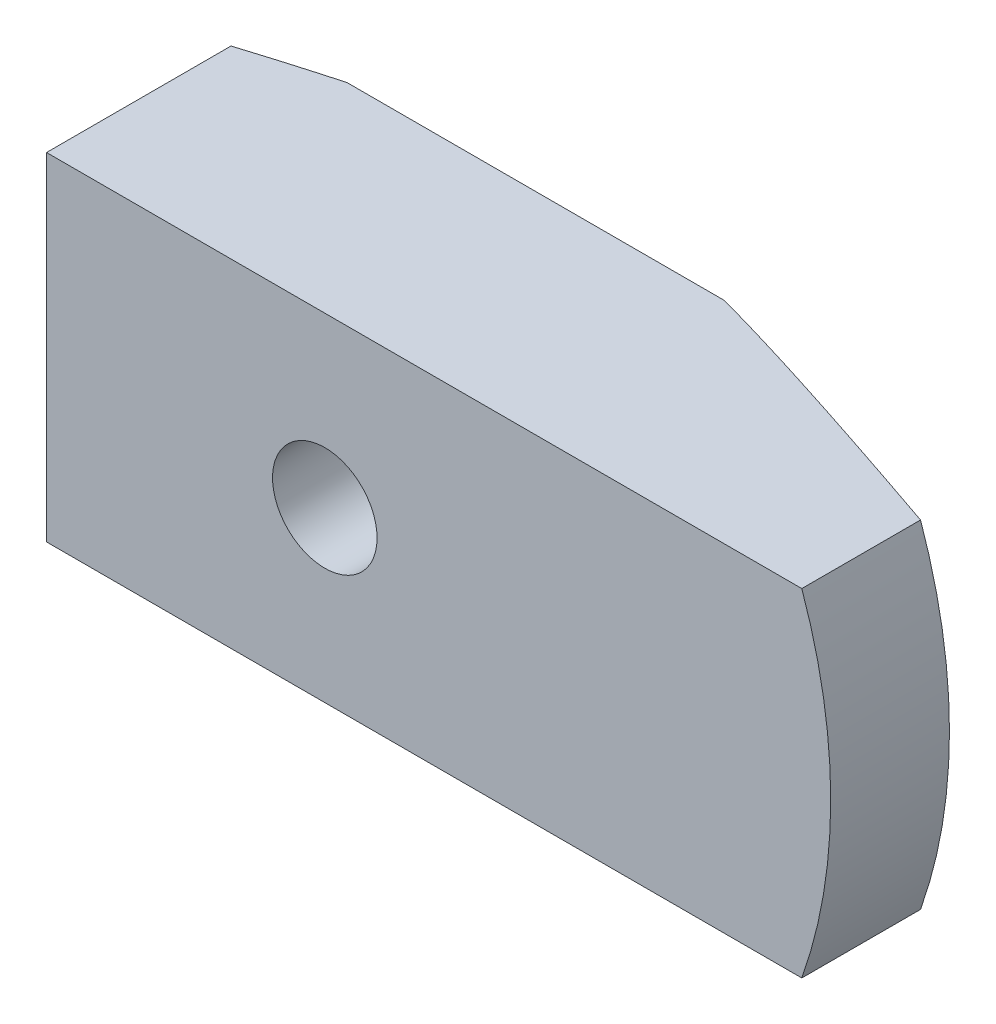
ISO-10303-21;
HEADER;
FILE_DESCRIPTION(('STEP AP214'),'2;1');
FILE_NAME('part.step','',(''),(''),'','','');
FILE_SCHEMA(('AUTOMOTIVE_DESIGN { 1 0 10303 214 1 1 1 1 }'));
ENDSEC;
DATA;
#1=APPLICATION_CONTEXT('core data for automotive mechanical design processes');
#2=APPLICATION_PROTOCOL_DEFINITION('international standard','automotive_design',2000,#1);
#3=PRODUCT_CONTEXT('',#1,'mechanical');
#4=PRODUCT('Part','Part','',(#3));
#5=PRODUCT_RELATED_PRODUCT_CATEGORY('part','',(#4));
#6=PRODUCT_DEFINITION_FORMATION('','',#4);
#7=PRODUCT_DEFINITION_CONTEXT('part definition',#1,'design');
#8=PRODUCT_DEFINITION('design','',#6,#7);
#9=PRODUCT_DEFINITION_SHAPE('','',#8);
#10=(LENGTH_UNIT() NAMED_UNIT(*) SI_UNIT(.MILLI.,.METRE.));
#11=(NAMED_UNIT(*) PLANE_ANGLE_UNIT() SI_UNIT($,.RADIAN.));
#12=(NAMED_UNIT(*) SI_UNIT($,.STERADIAN.) SOLID_ANGLE_UNIT());
#13=UNCERTAINTY_MEASURE_WITH_UNIT(LENGTH_MEASURE(1.E-05),#10,'distance_accuracy_value','');
#14=(GEOMETRIC_REPRESENTATION_CONTEXT(3) GLOBAL_UNCERTAINTY_ASSIGNED_CONTEXT((#13)) GLOBAL_UNIT_ASSIGNED_CONTEXT((#10,
#11,#12)) REPRESENTATION_CONTEXT('',''));
#15=CARTESIAN_POINT('',(0.,0.,0.));
#16=DIRECTION('',(0.,0.,1.));
#17=DIRECTION('',(1.,0.,0.));
#18=AXIS2_PLACEMENT_3D('',#15,#16,#17);
#19=CARTESIAN_POINT('',(0.,0.,0.));
#20=DIRECTION('',(0.,0.,1.));
#21=DIRECTION('',(1.,0.,0.));
#22=AXIS2_PLACEMENT_3D('',#19,#20,#21);
#23=PLANE('',#22);
#24=CARTESIAN_POINT('',(0.,0.,0.));
#25=DIRECTION('',(0.,0.,1.));
#26=DIRECTION('',(1.,0.,0.));
#27=AXIS2_PLACEMENT_3D('',#24,#25,#26);
#28=CIRCLE('',#27,2.45057562604023);
#29=CARTESIAN_POINT('',(2.45057562604023,0.,0.));
#30=VERTEX_POINT('',#29);
#31=EDGE_CURVE('E130',#30,#30,#28,.T.);
#32=ORIENTED_EDGE('',*,*,#31,.T.);
#33=EDGE_LOOP('',(#32));
#34=FACE_BOUND('',#33,.T.);
#35=CARTESIAN_POINT('',(0.,0.,0.));
#36=DIRECTION('',(0.,0.,1.));
#37=DIRECTION('',(1.,0.,0.));
#38=AXIS2_PLACEMENT_3D('',#35,#36,#37);
#39=CIRCLE('',#38,19.0499999999998);
#40=CARTESIAN_POINT('',(14.1990316571234,12.7,0.));
#41=VERTEX_POINT('',#40);
#42=CARTESIAN_POINT('',(14.1990316571234,-12.7,0.));
#43=VERTEX_POINT('',#42);
#44=EDGE_CURVE('E145',#41,#43,#39,.F.);
#45=ORIENTED_EDGE('',*,*,#44,.T.);
#46=DIRECTION('',(-1.,0.,0.));
#47=VECTOR('',#46,1.);
#48=CARTESIAN_POINT('',(0.,-12.7,0.));
#49=LINE('',#48,#47);
#50=CARTESIAN_POINT('',(-14.1990316571234,-12.7,0.));
#51=VERTEX_POINT('',#50);
#52=EDGE_CURVE('E104',#43,#51,#49,.T.);
#53=ORIENTED_EDGE('',*,*,#52,.T.);
#54=CARTESIAN_POINT('',(-14.1990316571234,12.7,0.));
#55=VERTEX_POINT('',#54);
#56=EDGE_CURVE('E148',#51,#55,#39,.F.);
#57=ORIENTED_EDGE('',*,*,#56,.T.);
#58=DIRECTION('',(-1.,0.,0.));
#59=VECTOR('',#58,1.);
#60=CARTESIAN_POINT('',(0.,12.7,0.));
#61=LINE('',#60,#59);
#62=EDGE_CURVE('E121',#41,#55,#61,.T.);
#63=ORIENTED_EDGE('',*,*,#62,.F.);
#64=EDGE_LOOP('',(#45,#53,#57,#63));
#65=FACE_BOUND('',#64,.T.);
#66=ADVANCED_FACE('F40',(#34,#65),#23,.F.);
#67=CARTESIAN_POINT('',(0.,0.,6.93363296277117));
#68=DIRECTION('',(0.,0.,1.));
#69=DIRECTION('',(1.,0.,0.));
#70=AXIS2_PLACEMENT_3D('',#67,#68,#69);
#71=CONICAL_SURFACE('',#70,38.1,1.22173047639603);
#72=CARTESIAN_POINT('',(-20.9557,-12.7,1.98498482904754));
#73=CARTESIAN_POINT('',(-20.5350826291581,-12.7,1.85407005006191));
#74=CARTESIAN_POINT('',(-20.1141687377061,-12.7,1.72410150834206));
#75=CARTESIAN_POINT('',(-19.271653973241,-12.7,1.46638807597938));
#76=CARTESIAN_POINT('',(-18.8500530897183,-12.7,1.33864321971081));
#77=CARTESIAN_POINT('',(-18.0059762140157,-12.7,1.08568028009348));
#78=CARTESIAN_POINT('',(-17.5835000267744,-12.7,0.960462846723263));
#79=CARTESIAN_POINT('',(-16.7376774286355,-12.7,0.713004172347333));
#80=CARTESIAN_POINT('',(-16.3143310206856,-12.7,0.590762921278329));
#81=CARTESIAN_POINT('',(-15.4611469909782,-12.7,0.348184507243866));
#82=CARTESIAN_POINT('',(-15.0312964583022,-12.7,0.227892676558113));
#83=CARTESIAN_POINT('',(-14.17044850617,-12.7,-0.00851407825334039));
#84=CARTESIAN_POINT('',(-13.7394510926394,-12.7,-0.124629023914819));
#85=CARTESIAN_POINT('',(-12.8761682582988,-12.7,-0.351939033447619));
#86=CARTESIAN_POINT('',(-12.4438828683618,-12.7,-0.463134214250361));
#87=CARTESIAN_POINT('',(-11.5778577151222,-12.7,-0.679719720547179));
#88=CARTESIAN_POINT('',(-11.1441179541082,-12.7,-0.78511005517159));
#89=CARTESIAN_POINT('',(-10.2953870331918,-12.7,-0.984253219822242));
#90=CARTESIAN_POINT('',(-9.88047001152434,-12.7,-1.07831998230008));
#91=CARTESIAN_POINT('',(-9.04905595342542,-12.7,-1.25914701900106));
#92=CARTESIAN_POINT('',(-8.63255890868369,-12.7,-1.34590725473922));
#93=CARTESIAN_POINT('',(-7.38044062465282,-12.7,-1.59344198859504));
#94=CARTESIAN_POINT('',(-6.54218449447965,-12.7,-1.74147237453626));
#95=CARTESIAN_POINT('',(-5.28234539857609,-12.7,-1.92923572655855));
#96=CARTESIAN_POINT('',(-4.86327398440486,-12.7,-1.98598815052408));
#97=CARTESIAN_POINT('',(-4.02362773351995,-12.7,-2.08691368777628));
#98=CARTESIAN_POINT('',(-3.6030530035997,-12.7,-2.13108767731566));
#99=CARTESIAN_POINT('',(-2.76075897257413,-12.7,-2.20559071330719));
#100=CARTESIAN_POINT('',(-2.33903993414609,-12.7,-2.2359227046657));
#101=CARTESIAN_POINT('',(-1.49479042033434,-12.7,-2.28178273946309));
#102=CARTESIAN_POINT('',(-1.07225994731752,-12.7,-2.29731082601827));
#103=CARTESIAN_POINT('',(-0.211495909248064,-12.7,-2.31331259814963));
#104=CARTESIAN_POINT('',(0.226748475978188,-12.7,-2.31321672459354));
#105=CARTESIAN_POINT('',(1.10292158357223,-12.7,-2.29654644584404));
#106=CARTESIAN_POINT('',(1.54085030361133,-12.7,-2.27997192030639));
#107=CARTESIAN_POINT('',(2.4159115432714,-12.7,-2.23095107317192));
#108=CARTESIAN_POINT('',(2.85304385821831,-12.7,-2.19850112769338));
#109=CARTESIAN_POINT('',(3.72594023408547,-12.7,-2.11884174311568));
#110=CARTESIAN_POINT('',(4.16170428275187,-12.7,-2.07163217221171));
#111=CARTESIAN_POINT('',(5.46994585953874,-12.7,-1.90957764493929));
#112=CARTESIAN_POINT('',(6.33995809153765,-12.7,-1.77451845146312));
#113=CARTESIAN_POINT('',(7.63918685144147,-12.7,-1.54115717045184));
#114=CARTESIAN_POINT('',(8.07132209959072,-12.7,-1.45823584837538));
#115=CARTESIAN_POINT('',(8.9338249099487,-12.7,-1.283590411886));
#116=CARTESIAN_POINT('',(9.36419247328672,-12.7,-1.19186630309771));
#117=CARTESIAN_POINT('',(10.2284341138709,-12.7,-0.999775714954983));
#118=CARTESIAN_POINT('',(10.6622878079513,-12.7,-0.899318276849593));
#119=CARTESIAN_POINT('',(11.5284348899843,-12.7,-0.691904606393946));
#120=CARTESIAN_POINT('',(11.9607282783856,-12.7,-0.584948375912458));
#121=CARTESIAN_POINT('',(12.8238817124813,-12.7,-0.365543172856491));
#122=CARTESIAN_POINT('',(13.2547418583537,-12.7,-0.253094593174052));
#123=CARTESIAN_POINT('',(14.1152182116344,-12.7,-0.0235271018429562));
#124=CARTESIAN_POINT('',(14.5448344042083,-12.7,0.0935918652578122));
#125=CARTESIAN_POINT('',(15.8307342825678,-12.7,0.450513790736049));
#126=CARTESIAN_POINT('',(16.6853796798906,-12.7,0.696219656096335));
#127=CARTESIAN_POINT('',(18.3912578118399,-12.7,1.19911727339636));
#128=CARTESIAN_POINT('',(19.2424905514317,-12.7,1.45630900861759));
#129=CARTESIAN_POINT('',(20.7627752617671,-12.7,1.92405191642953));
#130=CARTESIAN_POINT('',(21.4323282794615,-12.7,2.1329793560527));
#131=CARTESIAN_POINT('',(22.7700757375761,-12.7,2.55514331813787));
#132=CARTESIAN_POINT('',(23.4382701724364,-12.7,2.76837985819589));
#133=CARTESIAN_POINT('',(24.7737235811915,-12.7,3.19841559976963));
#134=CARTESIAN_POINT('',(25.4409822284407,-12.7,3.41521581435765));
#135=CARTESIAN_POINT('',(26.7745573349844,-12.7,3.8516954632171));
#136=CARTESIAN_POINT('',(27.4408737929855,-12.7,4.07137490143703));
#137=CARTESIAN_POINT('',(28.7593904255413,-12.7,4.50870416385439));
#138=CARTESIAN_POINT('',(29.4116063097689,-12.7,4.7263066603673));
#139=CARTESIAN_POINT('',(30.7153905830653,-12.7,5.16344172169199));
#140=CARTESIAN_POINT('',(31.3669589721804,-12.7,5.3829742863655));
#141=CARTESIAN_POINT('',(32.6693336739534,-12.7,5.82360232843634));
#142=CARTESIAN_POINT('',(33.3201401640964,-12.7,6.0446972815337));
#143=CARTESIAN_POINT('',(34.6212732832605,-12.7,6.48829015822874));
#144=CARTESIAN_POINT('',(35.2715999133624,-12.7,6.71078807865589));
#145=CARTESIAN_POINT('',(35.9217244842766,-12.7,6.93387317113063));
#146=B_SPLINE_CURVE_WITH_KNOTS('',3,(#72,#73,#74,#75,#76,#77,#78,#79,#80,#81,#82,#83,#84,#85,
#86,#87,#88,#89,#90,#91,#92,#93,#94,#95,#96,#97,#98,#99,#100,#101,#102,#103,#104,#105,#106,#107,
#108,#109,#110,#111,#112,#113,#114,#115,#116,#117,#118,#119,#120,#121,#122,#123,#124,#125,#126,
#127,#128,#129,#130,#131,#132,#133,#134,#135,#136,#137,#138,#139,#140,#141,#142,#143,#144,#145),
.UNSPECIFIED.,.F.,.F.,(4,2,2,2,2,2,2,2,2,2,2,2,2,2,2,2,2,2,2,2,2,2,2,2,2,2,2,2,2,2,2,2,2,2,2,2,
4),(0.,1.32156099582395,2.64314240254573,3.96505945863296,5.28697204433276,6.62604877238022,
7.96511859523569,9.30415657438602,10.6431924473282,11.9194648362219,13.1957439470817,
15.7482782966553,17.0168172216695,18.2852677546988,19.5534482969736,20.8216251456676,
22.1360423622678,23.4504691781794,24.7651961783659,26.0799349195204,28.7196574233081,
30.0396658402218,31.3596734137091,32.6956151534255,34.0315565089854,35.3674024383136,
36.7032642330379,39.3709287166353,42.0385893173851,44.142750973084,46.2469212227683,
48.3517003563911,50.4564823767588,52.5191537505279,54.5818249765404,56.643834104292,
58.705838573822),.UNSPECIFIED.);
#147=CARTESIAN_POINT('',(35.9210244842766,-12.7,6.93363296277117));
#148=VERTEX_POINT('',#147);
#149=EDGE_CURVE('E11',#43,#148,#146,.T.);
#150=ORIENTED_EDGE('',*,*,#149,.F.);
#151=ORIENTED_EDGE('',*,*,#44,.F.);
#152=CARTESIAN_POINT('',(-20.9557,12.7,1.98498482904754));
#153=CARTESIAN_POINT('',(-20.5350826291581,12.7,1.85407005006191));
#154=CARTESIAN_POINT('',(-20.1141687377061,12.7,1.72410150834206));
#155=CARTESIAN_POINT('',(-19.271653973241,12.7,1.46638807597938));
#156=CARTESIAN_POINT('',(-18.8500530897183,12.7,1.33864321971082));
#157=CARTESIAN_POINT('',(-18.0059762140157,12.7,1.08568028009348));
#158=CARTESIAN_POINT('',(-17.5835000267744,12.7,0.960462846723262));
#159=CARTESIAN_POINT('',(-16.7376774286355,12.7,0.713004172347332));
#160=CARTESIAN_POINT('',(-16.3143310206856,12.7,0.590762921278331));
#161=CARTESIAN_POINT('',(-15.4611469909782,12.7,0.348184507243868));
#162=CARTESIAN_POINT('',(-15.0312964583022,12.7,0.227892676558115));
#163=CARTESIAN_POINT('',(-14.17044850617,12.7,-0.00851407825333912));
#164=CARTESIAN_POINT('',(-13.7394510926394,12.7,-0.124629023914818));
#165=CARTESIAN_POINT('',(-12.8761682582988,12.7,-0.351939033447618));
#166=CARTESIAN_POINT('',(-12.4438828683618,12.7,-0.463134214250359));
#167=CARTESIAN_POINT('',(-11.5778577151222,12.7,-0.679719720547177));
#168=CARTESIAN_POINT('',(-11.1441179541082,12.7,-0.785110055171588));
#169=CARTESIAN_POINT('',(-10.2953870331918,12.7,-0.98425321982224));
#170=CARTESIAN_POINT('',(-9.88047001152434,12.7,-1.07831998230008));
#171=CARTESIAN_POINT('',(-9.04905595342542,12.7,-1.25914701900106));
#172=CARTESIAN_POINT('',(-8.63255890868369,12.7,-1.34590725473922));
#173=CARTESIAN_POINT('',(-7.38044062465282,12.7,-1.59344198859504));
#174=CARTESIAN_POINT('',(-6.54218449447965,12.7,-1.74147237453626));
#175=CARTESIAN_POINT('',(-5.28234539857609,12.7,-1.92923572655855));
#176=CARTESIAN_POINT('',(-4.86327398440486,12.7,-1.98598815052408));
#177=CARTESIAN_POINT('',(-4.02362773351995,12.7,-2.08691368777628));
#178=CARTESIAN_POINT('',(-3.6030530035997,12.7,-2.13108767731566));
#179=CARTESIAN_POINT('',(-2.76075897257413,12.7,-2.20559071330719));
#180=CARTESIAN_POINT('',(-2.33903993414609,12.7,-2.2359227046657));
#181=CARTESIAN_POINT('',(-1.49479042033434,12.7,-2.28178273946309));
#182=CARTESIAN_POINT('',(-1.07225994731752,12.7,-2.29731082601827));
#183=CARTESIAN_POINT('',(-0.211495909248063,12.7,-2.31331259814963));
#184=CARTESIAN_POINT('',(0.226748475978189,12.7,-2.31321672459353));
#185=CARTESIAN_POINT('',(1.10292158357223,12.7,-2.29654644584403));
#186=CARTESIAN_POINT('',(1.54085030361133,12.7,-2.27997192030639));
#187=CARTESIAN_POINT('',(2.4159115432714,12.7,-2.23095107317192));
#188=CARTESIAN_POINT('',(2.85304385821832,12.7,-2.19850112769338));
#189=CARTESIAN_POINT('',(3.72594023408547,12.7,-2.11884174311568));
#190=CARTESIAN_POINT('',(4.16170428275187,12.7,-2.07163217221171));
#191=CARTESIAN_POINT('',(5.46994585953874,12.7,-1.90957764493928));
#192=CARTESIAN_POINT('',(6.33995809153766,12.7,-1.77451845146312));
#193=CARTESIAN_POINT('',(7.63918685144147,12.7,-1.54115717045184));
#194=CARTESIAN_POINT('',(8.07132209959072,12.7,-1.45823584837538));
#195=CARTESIAN_POINT('',(8.9338249099487,12.7,-1.283590411886));
#196=CARTESIAN_POINT('',(9.36419247328672,12.7,-1.1918663030977));
#197=CARTESIAN_POINT('',(10.2284341138709,12.7,-0.999775714954979));
#198=CARTESIAN_POINT('',(10.6622878079513,12.7,-0.899318276849589));
#199=CARTESIAN_POINT('',(11.5284348899843,12.7,-0.691904606393942));
#200=CARTESIAN_POINT('',(11.9607282783856,12.7,-0.584948375912454));
#201=CARTESIAN_POINT('',(12.8238817124813,12.7,-0.365543172856488));
#202=CARTESIAN_POINT('',(13.2547418583537,12.7,-0.253094593174049));
#203=CARTESIAN_POINT('',(14.1152182116344,12.7,-0.0235271018429537));
#204=CARTESIAN_POINT('',(14.5448344042083,12.7,0.0935918652578145));
#205=CARTESIAN_POINT('',(15.8307342825678,12.7,0.450513790736052));
#206=CARTESIAN_POINT('',(16.6853796798906,12.7,0.696219656096341));
#207=CARTESIAN_POINT('',(18.3912578118399,12.7,1.19911727339636));
#208=CARTESIAN_POINT('',(19.2424905514317,12.7,1.4563090086176));
#209=CARTESIAN_POINT('',(20.7627752617671,12.7,1.92405191642953));
#210=CARTESIAN_POINT('',(21.4323282794615,12.7,2.1329793560527));
#211=CARTESIAN_POINT('',(22.7700757375761,12.7,2.55514331813788));
#212=CARTESIAN_POINT('',(23.4382701724364,12.7,2.76837985819589));
#213=CARTESIAN_POINT('',(24.7737235811915,12.7,3.19841559976963));
#214=CARTESIAN_POINT('',(25.4409822284407,12.7,3.41521581435765));
#215=CARTESIAN_POINT('',(26.7745573349844,12.7,3.8516954632171));
#216=CARTESIAN_POINT('',(27.4408737929855,12.7,4.07137490143703));
#217=CARTESIAN_POINT('',(28.7593904255413,12.7,4.50870416385439));
#218=CARTESIAN_POINT('',(29.4116063097689,12.7,4.72630666036731));
#219=CARTESIAN_POINT('',(30.7153905830653,12.7,5.16344172169199));
#220=CARTESIAN_POINT('',(31.3669589721804,12.7,5.3829742863655));
#221=CARTESIAN_POINT('',(32.6693336739534,12.7,5.82360232843634));
#222=CARTESIAN_POINT('',(33.3201401640964,12.7,6.0446972815337));
#223=CARTESIAN_POINT('',(34.6212732832605,12.7,6.48829015822874));
#224=CARTESIAN_POINT('',(35.2715999133624,12.7,6.71078807865589));
#225=CARTESIAN_POINT('',(35.9217244842766,12.7,6.93387317113063));
#226=B_SPLINE_CURVE_WITH_KNOTS('',3,(#152,#153,#154,#155,#156,#157,#158,#159,#160,#161,#162,
#163,#164,#165,#166,#167,#168,#169,#170,#171,#172,#173,#174,#175,#176,#177,#178,#179,#180,#181,
#182,#183,#184,#185,#186,#187,#188,#189,#190,#191,#192,#193,#194,#195,#196,#197,#198,#199,#200,
#201,#202,#203,#204,#205,#206,#207,#208,#209,#210,#211,#212,#213,#214,#215,#216,#217,#218,#219,
#220,#221,#222,#223,#224,#225),.UNSPECIFIED.,.F.,.F.,(4,2,2,2,2,2,2,2,2,2,2,2,2,2,2,2,2,2,2,2,2,
2,2,2,2,2,2,2,2,2,2,2,2,2,2,2,4),(0.,1.32156099582395,2.64314240254573,3.96505945863295,
5.28697204433276,6.62604877238022,7.96511859523568,9.30415657438602,10.6431924473282,
11.9194648362219,13.1957439470817,15.7482782966553,17.0168172216695,18.2852677546988,
19.5534482969736,20.8216251456676,22.1360423622678,23.4504691781794,24.7651961783659,
26.0799349195204,28.7196574233081,30.0396658402218,31.3596734137091,32.6956151534255,
34.0315565089854,35.3674024383136,36.7032642330379,39.3709287166353,42.0385893173851,
44.142750973084,46.2469212227683,48.3517003563911,50.4564823767588,52.5191537505279,
54.5818249765404,56.643834104292,58.705838573822),.UNSPECIFIED.);
#227=CARTESIAN_POINT('',(35.9210244842766,12.7,6.93363296277117));
#228=VERTEX_POINT('',#227);
#229=EDGE_CURVE('E149',#41,#228,#226,.T.);
#230=ORIENTED_EDGE('',*,*,#229,.T.);
#231=CARTESIAN_POINT('',(0.,0.,6.93363296277117));
#232=DIRECTION('',(0.,0.,1.));
#233=DIRECTION('',(1.,0.,0.));
#234=AXIS2_PLACEMENT_3D('',#231,#232,#233);
#235=CIRCLE('',#234,38.1);
#236=EDGE_CURVE('E142',#148,#228,#235,.T.);
#237=ORIENTED_EDGE('',*,*,#236,.F.);
#238=EDGE_LOOP('',(#150,#151,#230,#237));
#239=FACE_BOUND('',#238,.T.);
#240=ADVANCED_FACE('F183',(#239),#71,.T.);
#241=CARTESIAN_POINT('',(0.,0.,15.875));
#242=DIRECTION('',(0.,0.,-1.));
#243=DIRECTION('',(-1.,0.,0.));
#244=AXIS2_PLACEMENT_3D('',#241,#242,#243);
#245=CYLINDRICAL_SURFACE('',#244,38.1);
#246=CARTESIAN_POINT('',(0.,0.,15.875));
#247=DIRECTION('',(0.,0.,1.));
#248=DIRECTION('',(1.,0.,0.));
#249=AXIS2_PLACEMENT_3D('',#246,#247,#248);
#250=CIRCLE('',#249,38.1);
#251=CARTESIAN_POINT('',(35.9210244842766,-12.7,15.875));
#252=VERTEX_POINT('',#251);
#253=CARTESIAN_POINT('',(35.9210244842766,12.7,15.875));
#254=VERTEX_POINT('',#253);
#255=EDGE_CURVE('E118',#252,#254,#250,.T.);
#256=ORIENTED_EDGE('',*,*,#255,.F.);
#257=DIRECTION('',(0.,0.,1.));
#258=VECTOR('',#257,1.);
#259=CARTESIAN_POINT('',(35.9210244842766,-12.7,0.));
#260=LINE('',#259,#258);
#261=EDGE_CURVE('E127',#148,#252,#260,.T.);
#262=ORIENTED_EDGE('',*,*,#261,.F.);
#263=ORIENTED_EDGE('',*,*,#236,.T.);
#264=DIRECTION('',(0.,0.,1.));
#265=VECTOR('',#264,1.);
#266=CARTESIAN_POINT('',(35.9210244842766,12.7,0.));
#267=LINE('',#266,#265);
#268=EDGE_CURVE('E62',#228,#254,#267,.T.);
#269=ORIENTED_EDGE('',*,*,#268,.T.);
#270=EDGE_LOOP('',(#256,#262,#263,#269));
#271=FACE_BOUND('',#270,.T.);
#272=ADVANCED_FACE('F181',(#271),#245,.T.);
#273=CARTESIAN_POINT('',(0.,0.,15.875));
#274=DIRECTION('',(0.,0.,1.));
#275=DIRECTION('',(1.,0.,0.));
#276=AXIS2_PLACEMENT_3D('',#273,#274,#275);
#277=PLANE('',#276);
#278=DIRECTION('',(-1.,0.,0.));
#279=VECTOR('',#278,1.);
#280=CARTESIAN_POINT('',(0.,-12.7,15.875));
#281=LINE('',#280,#279);
#282=CARTESIAN_POINT('',(-20.955,-12.7,15.875));
#283=VERTEX_POINT('',#282);
#284=EDGE_CURVE('E119',#252,#283,#281,.T.);
#285=ORIENTED_EDGE('',*,*,#284,.F.);
#286=ORIENTED_EDGE('',*,*,#255,.T.);
#287=DIRECTION('',(-1.,0.,0.));
#288=VECTOR('',#287,1.);
#289=CARTESIAN_POINT('',(0.,12.7,15.875));
#290=LINE('',#289,#288);
#291=CARTESIAN_POINT('',(-20.955,12.7,15.875));
#292=VERTEX_POINT('',#291);
#293=EDGE_CURVE('E101',#254,#292,#290,.T.);
#294=ORIENTED_EDGE('',*,*,#293,.T.);
#295=DIRECTION('',(0.,-1.,0.));
#296=VECTOR('',#295,1.);
#297=CARTESIAN_POINT('',(-20.955,0.,15.875));
#298=LINE('',#297,#296);
#299=EDGE_CURVE('E107',#292,#283,#298,.T.);
#300=ORIENTED_EDGE('',*,*,#299,.T.);
#301=EDGE_LOOP('',(#285,#286,#294,#300));
#302=FACE_BOUND('',#301,.T.);
#303=CARTESIAN_POINT('',(0.,0.,15.875));
#304=DIRECTION('',(0.,0.,1.));
#305=DIRECTION('',(1.,0.,0.));
#306=AXIS2_PLACEMENT_3D('',#303,#304,#305);
#307=CIRCLE('',#306,3.937);
#308=CARTESIAN_POINT('',(3.937,0.,15.875));
#309=VERTEX_POINT('',#308);
#310=EDGE_CURVE('E133',#309,#309,#307,.T.);
#311=ORIENTED_EDGE('',*,*,#310,.F.);
#312=EDGE_LOOP('',(#311));
#313=FACE_BOUND('',#312,.T.);
#314=ADVANCED_FACE('F115',(#302,#313),#277,.T.);
#315=CARTESIAN_POINT('',(0.,0.,10.16));
#316=DIRECTION('',(0.,0.,1.));
#317=DIRECTION('',(1.,0.,0.));
#318=AXIS2_PLACEMENT_3D('',#315,#316,#317);
#319=CYLINDRICAL_SURFACE('',#318,3.937);
#320=CARTESIAN_POINT('',(0.,0.,10.16));
#321=DIRECTION('',(0.,0.,1.));
#322=DIRECTION('',(1.,0.,0.));
#323=AXIS2_PLACEMENT_3D('',#320,#321,#322);
#324=CIRCLE('',#323,3.937);
#325=CARTESIAN_POINT('',(3.937,0.,10.16));
#326=VERTEX_POINT('',#325);
#327=EDGE_CURVE('E136',#326,#326,#324,.T.);
#328=ORIENTED_EDGE('',*,*,#327,.F.);
#329=EDGE_LOOP('',(#328));
#330=FACE_BOUND('',#329,.T.);
#331=ORIENTED_EDGE('',*,*,#310,.T.);
#332=EDGE_LOOP('',(#331));
#333=FACE_BOUND('',#332,.T.);
#334=ADVANCED_FACE('F174',(#330,#333),#319,.F.);
#335=CARTESIAN_POINT('',(0.,0.,10.16));
#336=DIRECTION('',(0.,0.,1.));
#337=DIRECTION('',(1.,0.,0.));
#338=AXIS2_PLACEMENT_3D('',#335,#336,#337);
#339=PLANE('',#338);
#340=CARTESIAN_POINT('',(0.,0.,10.16));
#341=DIRECTION('',(0.,0.,1.));
#342=DIRECTION('',(1.,0.,0.));
#343=AXIS2_PLACEMENT_3D('',#340,#341,#342);
#344=CIRCLE('',#343,2.45057562604023);
#345=CARTESIAN_POINT('',(2.45057562604023,0.,10.16));
#346=VERTEX_POINT('',#345);
#347=EDGE_CURVE('E126',#346,#346,#344,.T.);
#348=ORIENTED_EDGE('',*,*,#347,.F.);
#349=EDGE_LOOP('',(#348));
#350=FACE_BOUND('',#349,.T.);
#351=ORIENTED_EDGE('',*,*,#327,.T.);
#352=EDGE_LOOP('',(#351));
#353=FACE_BOUND('',#352,.T.);
#354=ADVANCED_FACE('F170',(#350,#353),#339,.T.);
#355=CARTESIAN_POINT('',(0.,0.,0.));
#356=DIRECTION('',(0.,0.,1.));
#357=DIRECTION('',(1.,0.,0.));
#358=AXIS2_PLACEMENT_3D('',#355,#356,#357);
#359=CYLINDRICAL_SURFACE('',#358,2.45057562604023);
#360=ORIENTED_EDGE('',*,*,#31,.F.);
#361=EDGE_LOOP('',(#360));
#362=FACE_BOUND('',#361,.T.);
#363=ORIENTED_EDGE('',*,*,#347,.T.);
#364=EDGE_LOOP('',(#363));
#365=FACE_BOUND('',#364,.T.);
#366=ADVANCED_FACE('F167',(#362,#365),#359,.F.);
#367=CARTESIAN_POINT('',(-20.955,-12.7,1.98476694148136));
#368=VERTEX_POINT('',#367);
#369=EDGE_CURVE('E46',#368,#51,#146,.T.);
#370=ORIENTED_EDGE('',*,*,#369,.F.);
#371=CARTESIAN_POINT('',(-20.955,-39.0295612923372,9.18995542749896));
#372=CARTESIAN_POINT('',(-20.955,-38.2714013959195,8.94685024489662));
#373=CARTESIAN_POINT('',(-20.955,-37.5127878089017,8.70515195290121));
#374=CARTESIAN_POINT('',(-20.955,-35.9945014985503,8.22507717775125));
#375=CARTESIAN_POINT('',(-20.955,-35.2348287636369,7.98670073123291));
#376=CARTESIAN_POINT('',(-20.955,-33.7141277915819,7.51373288329666));
#377=CARTESIAN_POINT('',(-20.955,-32.95309930103,7.27914229572402));
#378=CARTESIAN_POINT('',(-20.955,-31.4296759343944,6.8144424340342));
#379=CARTESIAN_POINT('',(-20.955,-30.6672810615251,6.58433314939035));
#380=CARTESIAN_POINT('',(-20.955,-29.1285659031483,6.12568428840305));
#381=CARTESIAN_POINT('',(-20.955,-28.3522200223921,5.89723045876452));
#382=CARTESIAN_POINT('',(-20.955,-26.7976699825103,5.44673802074785));
#383=CARTESIAN_POINT('',(-20.955,-26.0194658322196,5.22469938193503));
#384=CARTESIAN_POINT('',(-20.955,-24.4609456803228,4.78825475272318));
#385=CARTESIAN_POINT('',(-20.955,-23.6806297553309,4.57384848931542));
#386=CARTESIAN_POINT('',(-20.955,-22.1175464823059,4.15414203537192));
#387=CARTESIAN_POINT('',(-20.955,-21.3347791364936,3.94884183658899));
#388=CARTESIAN_POINT('',(-20.955,-19.8017493715801,3.558155235172));
#389=CARTESIAN_POINT('',(-20.955,-19.0516097387017,3.37228842934082));
#390=CARTESIAN_POINT('',(-20.955,-17.5484775548512,3.0124196143882));
#391=CARTESIAN_POINT('',(-20.955,-16.7954850008276,2.83841761796092));
#392=CARTESIAN_POINT('',(-20.955,-15.2862422666564,2.5045168959287));
#393=CARTESIAN_POINT('',(-20.955,-14.5299916026004,2.34462034678428));
#394=CARTESIAN_POINT('',(-20.955,-13.0141162159199,2.04159646586617));
#395=CARTESIAN_POINT('',(-20.955,-12.2544914904494,1.89846914823945));
#396=CARTESIAN_POINT('',(-20.955,-10.738380748659,1.63310901737836));
#397=CARTESIAN_POINT('',(-20.955,-9.98192485717773,1.51070537289745));
#398=CARTESIAN_POINT('',(-20.955,-8.46572374492987,1.2883836639401));
#399=CARTESIAN_POINT('',(-20.955,-7.70597868717326,1.188464497853));
#400=CARTESIAN_POINT('',(-20.955,-6.18381157430061,1.01418142453446));
#401=CARTESIAN_POINT('',(-20.955,-5.42139060104057,0.93980817507843));
#402=CARTESIAN_POINT('',(-20.955,-3.89430017378169,0.819207853391456));
#403=CARTESIAN_POINT('',(-20.955,-3.1296307084991,0.772980922652014));
#404=CARTESIAN_POINT('',(-20.955,-1.50519962764508,0.706704846338402));
#405=CARTESIAN_POINT('',(-20.955,-0.645273669373166,0.690560082141902));
#406=CARTESIAN_POINT('',(-20.955,1.07443731489332,0.696966257501076));
#407=CARTESIAN_POINT('',(-20.955,1.93422233882198,0.719517721007026));
#408=CARTESIAN_POINT('',(-20.955,3.65228466430247,0.802130774517953));
#409=CARTESIAN_POINT('',(-20.955,4.51056127478966,0.862206510511294));
#410=CARTESIAN_POINT('',(-20.955,6.22396335200439,1.0169337400216));
#411=CARTESIAN_POINT('',(-20.955,7.07908874802256,1.11158600467896));
#412=CARTESIAN_POINT('',(-20.955,8.79358006033448,1.33249613671978));
#413=CARTESIAN_POINT('',(-20.955,9.65290736479351,1.45904994444528));
#414=CARTESIAN_POINT('',(-20.955,11.3671783140159,1.73877353781299));
#415=CARTESIAN_POINT('',(-20.955,12.2221219267904,1.89194351739657));
#416=CARTESIAN_POINT('',(-20.955,13.9277475368048,2.22056563454305));
#417=CARTESIAN_POINT('',(-20.955,14.7784292037666,2.3960194720507));
#418=CARTESIAN_POINT('',(-20.955,16.4757578465189,2.76533572024778));
#419=CARTESIAN_POINT('',(-20.955,17.3224048334126,2.9591980802477));
#420=CARTESIAN_POINT('',(-20.955,19.0563173759187,3.37259990761356));
#421=CARTESIAN_POINT('',(-20.955,19.943388175771,3.59295238617342));
#422=CARTESIAN_POINT('',(-20.955,21.7140213949774,4.04727489097988));
#423=CARTESIAN_POINT('',(-20.955,22.5975838080137,4.28124494173679));
#424=CARTESIAN_POINT('',(-20.955,24.3616092978644,4.7602681262618));
#425=CARTESIAN_POINT('',(-20.955,25.2420726303966,5.00532032133809));
#426=CARTESIAN_POINT('',(-20.955,27.0004069785448,5.50452167523697));
#427=CARTESIAN_POINT('',(-20.955,27.8782780025565,5.75867080456222));
#428=CARTESIAN_POINT('',(-20.955,29.6148610225698,6.26948786186848));
#429=CARTESIAN_POINT('',(-20.955,30.4736153566409,6.52601214694759));
#430=CARTESIAN_POINT('',(-20.955,32.1893037677981,7.04507986630079));
#431=CARTESIAN_POINT('',(-20.955,33.046237838459,7.30762332178327));
#432=CARTESIAN_POINT('',(-20.955,34.7583493053002,7.83769418634376));
#433=CARTESIAN_POINT('',(-20.955,35.6135270536326,8.10522045968904));
#434=CARTESIAN_POINT('',(-20.955,37.3225142732106,8.64455953705992));
#435=CARTESIAN_POINT('',(-20.955,38.1763237677565,8.91637226721722));
#436=CARTESIAN_POINT('',(-20.955,39.0295612923372,9.18995542749896));
#437=B_SPLINE_CURVE_WITH_KNOTS('',3,(#371,#372,#373,#374,#375,#376,#377,#378,#379,#380,#381,
#382,#383,#384,#385,#386,#387,#388,#389,#390,#391,#392,#393,#394,#395,#396,#397,#398,#399,#400,
#401,#402,#403,#404,#405,#406,#407,#408,#409,#410,#411,#412,#413,#414,#415,#416,#417,#418,#419,
#420,#421,#422,#423,#424,#425,#426,#427,#428,#429,#430,#431,#432,#433,#434,#435,#436),
.UNSPECIFIED.,.F.,.F.,(4,2,2,2,2,2,2,2,2,2,2,2,2,2,2,2,2,2,2,2,2,2,2,2,2,2,2,2,2,2,2,2,4),(0.,
2.38854974076118,4.77712580372053,7.16620867634637,9.55528593628929,11.9830470655963,
14.4107966753353,16.8384593574642,19.2661198408612,21.5845097571398,23.9029021538246,
26.2216516533849,28.5404031090895,30.8389962473559,33.1374767431906,35.4351157800707,
37.7327663670832,40.3121186556858,42.8915058692175,45.4718660535606,48.0522837897036,
50.6575818068911,53.2628988086374,55.8684146789191,58.4739233748874,61.2158783253342,
63.9578382111862,66.6995662779928,69.4412854553884,72.1300089821158,74.8187419839507,
77.5068694665314,80.1949506752563),.UNSPECIFIED.);
#438=CARTESIAN_POINT('',(-20.955,12.7,1.98476694148136));
#439=VERTEX_POINT('',#438);
#440=EDGE_CURVE('E70',#368,#439,#437,.T.);
#441=ORIENTED_EDGE('',*,*,#440,.T.);
#442=EDGE_CURVE('E103',#439,#55,#226,.T.);
#443=ORIENTED_EDGE('',*,*,#442,.T.);
#444=ORIENTED_EDGE('',*,*,#56,.F.);
#445=EDGE_LOOP('',(#370,#441,#443,#444));
#446=FACE_BOUND('',#445,.T.);
#447=ADVANCED_FACE('F43',(#446),#71,.T.);
#448=CARTESIAN_POINT('',(-20.955,0.,0.));
#449=DIRECTION('',(-1.,0.,0.));
#450=DIRECTION('',(0.,0.,1.));
#451=AXIS2_PLACEMENT_3D('',#448,#449,#450);
#452=PLANE('',#451);
#453=DIRECTION('',(0.,0.,1.));
#454=VECTOR('',#453,1.);
#455=CARTESIAN_POINT('',(-20.955,-12.7,0.));
#456=LINE('',#455,#454);
#457=EDGE_CURVE('E109',#368,#283,#456,.T.);
#458=ORIENTED_EDGE('',*,*,#457,.T.);
#459=ORIENTED_EDGE('',*,*,#299,.F.);
#460=DIRECTION('',(0.,0.,1.));
#461=VECTOR('',#460,1.);
#462=CARTESIAN_POINT('',(-20.955,12.7,0.));
#463=LINE('',#462,#461);
#464=EDGE_CURVE('E97',#439,#292,#463,.T.);
#465=ORIENTED_EDGE('',*,*,#464,.F.);
#466=ORIENTED_EDGE('',*,*,#440,.F.);
#467=EDGE_LOOP('',(#458,#459,#465,#466));
#468=FACE_BOUND('',#467,.T.);
#469=ADVANCED_FACE('F108',(#468),#452,.T.);
#470=CARTESIAN_POINT('',(0.,-12.7,0.));
#471=DIRECTION('',(0.,1.,0.));
#472=DIRECTION('',(-1.,0.,0.));
#473=AXIS2_PLACEMENT_3D('',#470,#471,#472);
#474=PLANE('',#473);
#475=ORIENTED_EDGE('',*,*,#369,.T.);
#476=ORIENTED_EDGE('',*,*,#52,.F.);
#477=ORIENTED_EDGE('',*,*,#149,.T.);
#478=ORIENTED_EDGE('',*,*,#261,.T.);
#479=ORIENTED_EDGE('',*,*,#284,.T.);
#480=ORIENTED_EDGE('',*,*,#457,.F.);
#481=EDGE_LOOP('',(#475,#476,#477,#478,#479,#480));
#482=FACE_BOUND('',#481,.T.);
#483=ADVANCED_FACE('F162',(#482),#474,.F.);
#484=CARTESIAN_POINT('',(0.,12.7,0.));
#485=DIRECTION('',(0.,1.,0.));
#486=DIRECTION('',(-1.,0.,0.));
#487=AXIS2_PLACEMENT_3D('',#484,#485,#486);
#488=PLANE('',#487);
#489=ORIENTED_EDGE('',*,*,#464,.T.);
#490=ORIENTED_EDGE('',*,*,#293,.F.);
#491=ORIENTED_EDGE('',*,*,#268,.F.);
#492=ORIENTED_EDGE('',*,*,#229,.F.);
#493=ORIENTED_EDGE('',*,*,#62,.T.);
#494=ORIENTED_EDGE('',*,*,#442,.F.);
#495=EDGE_LOOP('',(#489,#490,#491,#492,#493,#494));
#496=FACE_BOUND('',#495,.T.);
#497=ADVANCED_FACE('F99',(#496),#488,.T.);
#498=CLOSED_SHELL('',(#66,#240,#272,#314,#334,#354,#366,#447,#469,#483,#497));
#499=MANIFOLD_SOLID_BREP('B2',#498);
#500=ADVANCED_BREP_SHAPE_REPRESENTATION('',(#18,#499),#14);
#501=SHAPE_DEFINITION_REPRESENTATION(#9,#500);
ENDSEC;
END-ISO-10303-21;
